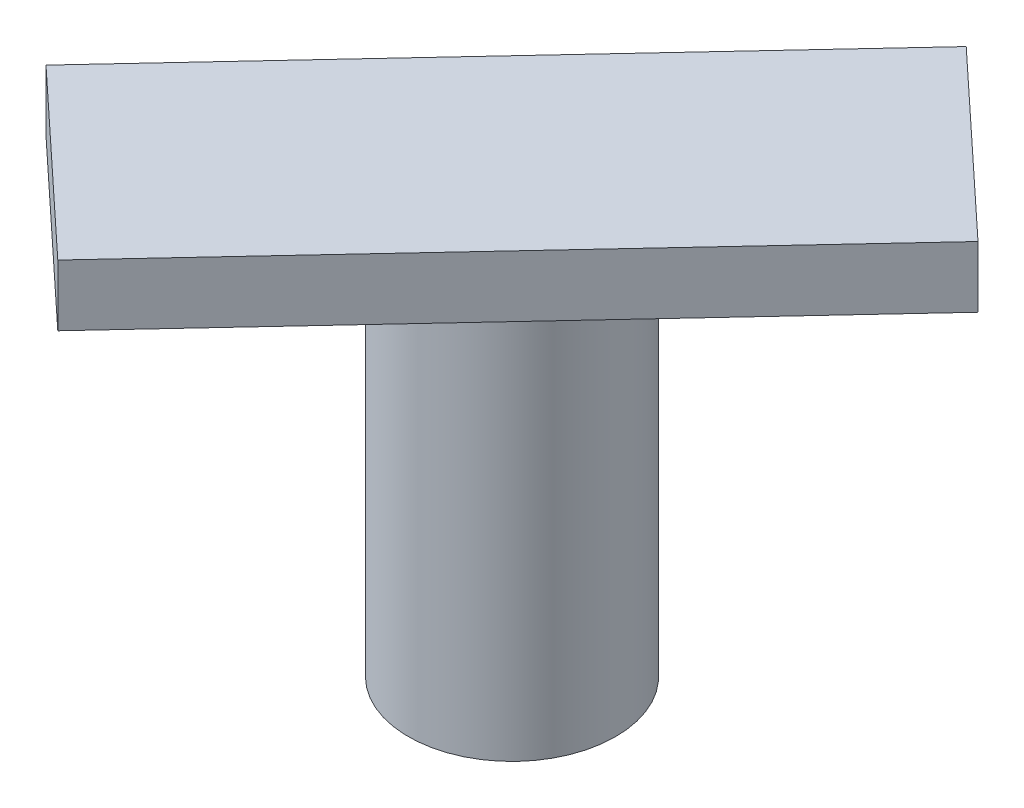
ISO-10303-21;
HEADER;
FILE_DESCRIPTION(('STEP AP214'),'2;1');
FILE_NAME('part.step','',(''),(''),'','','');
FILE_SCHEMA(('AUTOMOTIVE_DESIGN { 1 0 10303 214 1 1 1 1 }'));
ENDSEC;
DATA;
#1=APPLICATION_CONTEXT('core data for automotive mechanical design processes');
#2=APPLICATION_PROTOCOL_DEFINITION('international standard','automotive_design',2000,#1);
#3=PRODUCT_CONTEXT('',#1,'mechanical');
#4=PRODUCT('Part','Part','',(#3));
#5=PRODUCT_RELATED_PRODUCT_CATEGORY('part','',(#4));
#6=PRODUCT_DEFINITION_FORMATION('','',#4);
#7=PRODUCT_DEFINITION_CONTEXT('part definition',#1,'design');
#8=PRODUCT_DEFINITION('design','',#6,#7);
#9=PRODUCT_DEFINITION_SHAPE('','',#8);
#10=(LENGTH_UNIT() NAMED_UNIT(*) SI_UNIT(.MILLI.,.METRE.));
#11=(NAMED_UNIT(*) PLANE_ANGLE_UNIT() SI_UNIT($,.RADIAN.));
#12=(NAMED_UNIT(*) SI_UNIT($,.STERADIAN.) SOLID_ANGLE_UNIT());
#13=UNCERTAINTY_MEASURE_WITH_UNIT(LENGTH_MEASURE(1.E-05),#10,'distance_accuracy_value','');
#14=(GEOMETRIC_REPRESENTATION_CONTEXT(3) GLOBAL_UNCERTAINTY_ASSIGNED_CONTEXT((#13)) GLOBAL_UNIT_ASSIGNED_CONTEXT((#10,
#11,#12)) REPRESENTATION_CONTEXT('',''));
#15=CARTESIAN_POINT('',(0.,0.,0.));
#16=DIRECTION('',(0.,0.,1.));
#17=DIRECTION('',(1.,0.,0.));
#18=AXIS2_PLACEMENT_3D('',#15,#16,#17);
#19=CARTESIAN_POINT('',(22.7297936303225,64.,8.23955019099193));
#20=DIRECTION('',(0.,-1.,0.));
#21=DIRECTION('',(-0.731353701619305,0.,-0.681998360062354));
#22=AXIS2_PLACEMENT_3D('',#19,#20,#21);
#23=CYLINDRICAL_SURFACE('',#22,16.9166212319845);
#24=CARTESIAN_POINT('',(22.7297936303225,64.,8.23955019099193));
#25=DIRECTION('',(0.,1.,0.));
#26=DIRECTION('',(0.731353701619305,0.,0.681998360062354));
#27=AXIS2_PLACEMENT_3D('',#24,#25,#26);
#28=CIRCLE('',#27,16.9166212319845);
#29=CARTESIAN_POINT('',(35.1018271872261,64.,19.7766581290013));
#30=VERTEX_POINT('',#29);
#31=EDGE_CURVE('E11',#30,#30,#28,.T.);
#32=ORIENTED_EDGE('',*,*,#31,.F.);
#33=EDGE_LOOP('',(#32));
#34=FACE_BOUND('',#33,.T.);
#35=CARTESIAN_POINT('',(22.7297936303225,0.,8.23955019099193));
#36=DIRECTION('',(0.,1.,0.));
#37=DIRECTION('',(0.731353701619305,0.,0.681998360062354));
#38=AXIS2_PLACEMENT_3D('',#35,#36,#37);
#39=CIRCLE('',#38,16.9166212319845);
#40=CARTESIAN_POINT('',(35.1018271872261,0.,19.7766581290013));
#41=VERTEX_POINT('',#40);
#42=EDGE_CURVE('E37',#41,#41,#39,.T.);
#43=ORIENTED_EDGE('',*,*,#42,.T.);
#44=EDGE_LOOP('',(#43));
#45=FACE_BOUND('',#44,.T.);
#46=ADVANCED_FACE('F34',(#34,#45),#23,.T.);
#47=CARTESIAN_POINT('',(22.7297936303225,0.,8.23955019099193));
#48=DIRECTION('',(0.,1.,0.));
#49=DIRECTION('',(0.731353701619305,0.,0.681998360062354));
#50=AXIS2_PLACEMENT_3D('',#47,#48,#49);
#51=PLANE('',#50);
#52=ORIENTED_EDGE('',*,*,#42,.F.);
#53=EDGE_LOOP('',(#52));
#54=FACE_BOUND('',#53,.T.);
#55=ADVANCED_FACE('F113',(#54),#51,.F.);
#56=CARTESIAN_POINT('',(73.2222725790992,74.,-17.3235930102862));
#57=DIRECTION('',(-0.681998360062354,0.,0.731353701619305));
#58=DIRECTION('',(0.731353701619305,0.,0.681998360062354));
#59=AXIS2_PLACEMENT_3D('',#56,#57,#58);
#60=PLANE('',#59);
#61=DIRECTION('',(-0.731353701619305,0.,-0.681998360062354));
#62=VECTOR('',#61,1.);
#63=CARTESIAN_POINT('',(73.2222725790992,64.,-17.3235930102862));
#64=LINE('',#63,#62);
#65=CARTESIAN_POINT('',(73.2222725790992,64.,-17.3235930102862));
#66=VERTEX_POINT('',#65);
#67=CARTESIAN_POINT('',(44.7084890174746,64.,-43.9131263443547));
#68=VERTEX_POINT('',#67);
#69=EDGE_CURVE('E101',#66,#68,#64,.T.);
#70=ORIENTED_EDGE('',*,*,#69,.T.);
#71=DIRECTION('',(0.,-1.,0.));
#72=VECTOR('',#71,1.);
#73=CARTESIAN_POINT('',(44.7084890174746,74.,-43.9131263443547));
#74=LINE('',#73,#72);
#75=CARTESIAN_POINT('',(44.7084890174746,74.,-43.9131263443547));
#76=VERTEX_POINT('',#75);
#77=EDGE_CURVE('E92',#76,#68,#74,.T.);
#78=ORIENTED_EDGE('',*,*,#77,.F.);
#79=DIRECTION('',(-0.731353701619305,0.,-0.681998360062354));
#80=VECTOR('',#79,1.);
#81=CARTESIAN_POINT('',(73.2222725790992,74.,-17.3235930102862));
#82=LINE('',#81,#80);
#83=CARTESIAN_POINT('',(73.2222725790992,74.,-17.3235930102862));
#84=VERTEX_POINT('',#83);
#85=EDGE_CURVE('E86',#84,#76,#82,.T.);
#86=ORIENTED_EDGE('',*,*,#85,.F.);
#87=DIRECTION('',(0.,-1.,0.));
#88=VECTOR('',#87,1.);
#89=CARTESIAN_POINT('',(73.2222725790992,74.,-17.3235930102862));
#90=LINE('',#89,#88);
#91=EDGE_CURVE('E97',#84,#66,#90,.T.);
#92=ORIENTED_EDGE('',*,*,#91,.T.);
#93=EDGE_LOOP('',(#70,#78,#86,#92));
#94=FACE_BOUND('',#93,.T.);
#95=ADVANCED_FACE('F115',(#94),#60,.F.);
#96=CARTESIAN_POINT('',(-27.7626853184543,74.,33.8026933922701));
#97=DIRECTION('',(0.731353701619305,0.,0.681998360062354));
#98=DIRECTION('',(0.681998360062354,0.,-0.731353701619305));
#99=AXIS2_PLACEMENT_3D('',#96,#97,#98);
#100=PLANE('',#99);
#101=DIRECTION('',(-0.681998360062354,0.,0.731353701619305));
#102=VECTOR('',#101,1.);
#103=CARTESIAN_POINT('',(-27.7626853184543,64.,33.8026933922701));
#104=LINE('',#103,#102);
#105=CARTESIAN_POINT('',(-27.7626853184543,64.,33.8026933922701));
#106=VERTEX_POINT('',#105);
#107=EDGE_CURVE('E91',#68,#106,#104,.T.);
#108=ORIENTED_EDGE('',*,*,#107,.T.);
#109=DIRECTION('',(0.,-1.,0.));
#110=VECTOR('',#109,1.);
#111=CARTESIAN_POINT('',(-27.7626853184543,74.,33.8026933922701));
#112=LINE('',#111,#110);
#113=CARTESIAN_POINT('',(-27.7626853184543,74.,33.8026933922701));
#114=VERTEX_POINT('',#113);
#115=EDGE_CURVE('E89',#114,#106,#112,.T.);
#116=ORIENTED_EDGE('',*,*,#115,.F.);
#117=DIRECTION('',(-0.681998360062354,0.,0.731353701619305));
#118=VECTOR('',#117,1.);
#119=CARTESIAN_POINT('',(-27.7626853184543,74.,33.8026933922701));
#120=LINE('',#119,#118);
#121=EDGE_CURVE('E81',#76,#114,#120,.T.);
#122=ORIENTED_EDGE('',*,*,#121,.F.);
#123=ORIENTED_EDGE('',*,*,#77,.T.);
#124=EDGE_LOOP('',(#108,#116,#122,#123));
#125=FACE_BOUND('',#124,.T.);
#126=ADVANCED_FACE('F90',(#125),#100,.F.);
#127=CARTESIAN_POINT('',(0.751098243170327,74.,60.3922267263385));
#128=DIRECTION('',(0.681998360062354,0.,-0.731353701619305));
#129=DIRECTION('',(-0.731353701619305,0.,-0.681998360062354));
#130=AXIS2_PLACEMENT_3D('',#127,#128,#129);
#131=PLANE('',#130);
#132=DIRECTION('',(0.731353701619305,0.,0.681998360062354));
#133=VECTOR('',#132,1.);
#134=CARTESIAN_POINT('',(0.751098243170327,64.,60.3922267263385));
#135=LINE('',#134,#133);
#136=CARTESIAN_POINT('',(0.751098243170327,64.,60.3922267263385));
#137=VERTEX_POINT('',#136);
#138=EDGE_CURVE('E67',#106,#137,#135,.T.);
#139=ORIENTED_EDGE('',*,*,#138,.T.);
#140=DIRECTION('',(0.,-1.,0.));
#141=VECTOR('',#140,1.);
#142=CARTESIAN_POINT('',(0.751098243170327,74.,60.3922267263385));
#143=LINE('',#142,#141);
#144=CARTESIAN_POINT('',(0.751098243170327,74.,60.3922267263385));
#145=VERTEX_POINT('',#144);
#146=EDGE_CURVE('E93',#145,#137,#143,.T.);
#147=ORIENTED_EDGE('',*,*,#146,.F.);
#148=DIRECTION('',(0.731353701619305,0.,0.681998360062354));
#149=VECTOR('',#148,1.);
#150=CARTESIAN_POINT('',(0.751098243170327,74.,60.3922267263385));
#151=LINE('',#150,#149);
#152=EDGE_CURVE('E84',#114,#145,#151,.T.);
#153=ORIENTED_EDGE('',*,*,#152,.F.);
#154=ORIENTED_EDGE('',*,*,#115,.T.);
#155=EDGE_LOOP('',(#139,#147,#153,#154));
#156=FACE_BOUND('',#155,.T.);
#157=ADVANCED_FACE('F95',(#156),#131,.F.);
#158=CARTESIAN_POINT('',(0.751098243170327,74.,60.3922267263385));
#159=DIRECTION('',(-0.731353701619305,0.,-0.681998360062354));
#160=DIRECTION('',(-0.681998360062354,0.,0.731353701619305));
#161=AXIS2_PLACEMENT_3D('',#158,#159,#160);
#162=PLANE('',#161);
#163=DIRECTION('',(0.681998360062354,0.,-0.731353701619305));
#164=VECTOR('',#163,1.);
#165=CARTESIAN_POINT('',(0.751098243170327,64.,60.3922267263385));
#166=LINE('',#165,#164);
#167=EDGE_CURVE('E73',#137,#66,#166,.T.);
#168=ORIENTED_EDGE('',*,*,#167,.T.);
#169=ORIENTED_EDGE('',*,*,#91,.F.);
#170=DIRECTION('',(0.681998360062354,0.,-0.731353701619305));
#171=VECTOR('',#170,1.);
#172=CARTESIAN_POINT('',(0.751098243170327,74.,60.3922267263385));
#173=LINE('',#172,#171);
#174=EDGE_CURVE('E50',#145,#84,#173,.T.);
#175=ORIENTED_EDGE('',*,*,#174,.F.);
#176=ORIENTED_EDGE('',*,*,#146,.T.);
#177=EDGE_LOOP('',(#168,#169,#175,#176));
#178=FACE_BOUND('',#177,.T.);
#179=ADVANCED_FACE('F128',(#178),#162,.F.);
#180=CARTESIAN_POINT('',(1.2020861180268,74.,19.2437091816633));
#181=DIRECTION('',(0.,-1.,0.));
#182=DIRECTION('',(-0.731353701619305,0.,-0.681998360062354));
#183=AXIS2_PLACEMENT_3D('',#180,#181,#182);
#184=PLANE('',#183);
#185=ORIENTED_EDGE('',*,*,#85,.T.);
#186=ORIENTED_EDGE('',*,*,#121,.T.);
#187=ORIENTED_EDGE('',*,*,#152,.T.);
#188=ORIENTED_EDGE('',*,*,#174,.T.);
#189=EDGE_LOOP('',(#185,#186,#187,#188));
#190=FACE_BOUND('',#189,.T.);
#191=ADVANCED_FACE('F82',(#190),#184,.F.);
#192=CARTESIAN_POINT('',(1.2020861180268,64.,19.2437091816633));
#193=DIRECTION('',(0.,-1.,0.));
#194=DIRECTION('',(-0.731353701619305,0.,-0.681998360062354));
#195=AXIS2_PLACEMENT_3D('',#192,#193,#194);
#196=PLANE('',#195);
#197=ORIENTED_EDGE('',*,*,#31,.T.);
#198=EDGE_LOOP('',(#197));
#199=FACE_BOUND('',#198,.T.);
#200=ORIENTED_EDGE('',*,*,#69,.F.);
#201=ORIENTED_EDGE('',*,*,#167,.F.);
#202=ORIENTED_EDGE('',*,*,#138,.F.);
#203=ORIENTED_EDGE('',*,*,#107,.F.);
#204=EDGE_LOOP('',(#200,#201,#202,#203));
#205=FACE_BOUND('',#204,.T.);
#206=ADVANCED_FACE('F131',(#199,#205),#196,.T.);
#207=CLOSED_SHELL('',(#46,#55,#95,#126,#157,#179,#191,#206));
#208=MANIFOLD_SOLID_BREP('B2',#207);
#209=ADVANCED_BREP_SHAPE_REPRESENTATION('',(#18,#208),#14);
#210=SHAPE_DEFINITION_REPRESENTATION(#9,#209);
ENDSEC;
END-ISO-10303-21;
